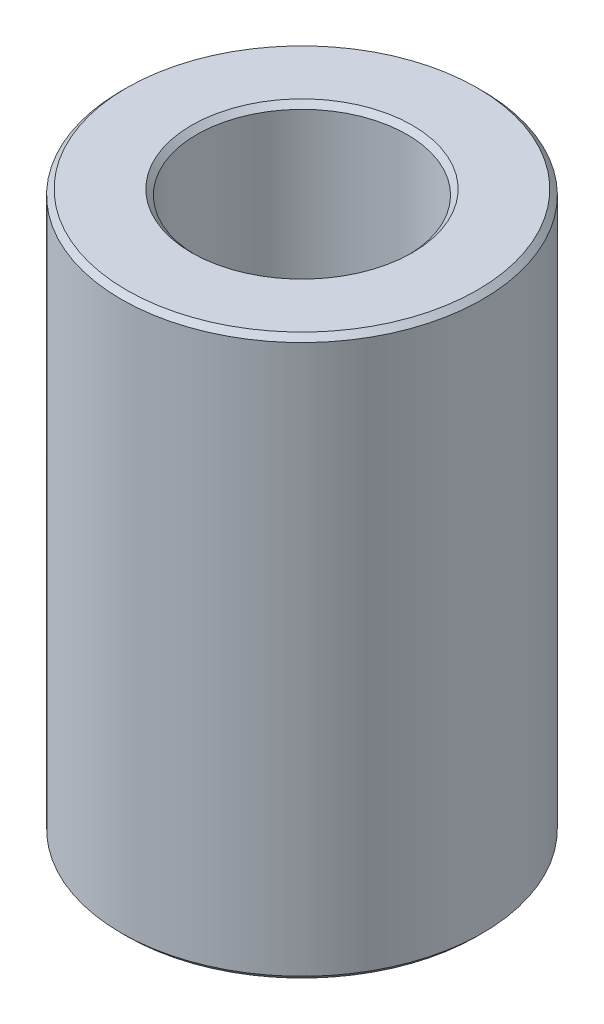
ISO-10303-21;
HEADER;
FILE_DESCRIPTION(('STEP AP214'),'2;1');
FILE_NAME('part.step','',(''),(''),'','','');
FILE_SCHEMA(('AUTOMOTIVE_DESIGN { 1 0 10303 214 1 1 1 1 }'));
ENDSEC;
DATA;
#1=APPLICATION_CONTEXT('core data for automotive mechanical design processes');
#2=APPLICATION_PROTOCOL_DEFINITION('international standard','automotive_design',2000,#1);
#3=PRODUCT_CONTEXT('',#1,'mechanical');
#4=PRODUCT('Part','Part','',(#3));
#5=PRODUCT_RELATED_PRODUCT_CATEGORY('part','',(#4));
#6=PRODUCT_DEFINITION_FORMATION('','',#4);
#7=PRODUCT_DEFINITION_CONTEXT('part definition',#1,'design');
#8=PRODUCT_DEFINITION('design','',#6,#7);
#9=PRODUCT_DEFINITION_SHAPE('','',#8);
#10=(LENGTH_UNIT() NAMED_UNIT(*) SI_UNIT(.MILLI.,.METRE.));
#11=(NAMED_UNIT(*) PLANE_ANGLE_UNIT() SI_UNIT($,.RADIAN.));
#12=(NAMED_UNIT(*) SI_UNIT($,.STERADIAN.) SOLID_ANGLE_UNIT());
#13=UNCERTAINTY_MEASURE_WITH_UNIT(LENGTH_MEASURE(1.E-05),#10,'distance_accuracy_value','');
#14=(GEOMETRIC_REPRESENTATION_CONTEXT(3) GLOBAL_UNCERTAINTY_ASSIGNED_CONTEXT((#13)) GLOBAL_UNIT_ASSIGNED_CONTEXT((#10,
#11,#12)) REPRESENTATION_CONTEXT('',''));
#15=CARTESIAN_POINT('',(0.,0.,0.));
#16=DIRECTION('',(0.,0.,1.));
#17=DIRECTION('',(1.,0.,0.));
#18=AXIS2_PLACEMENT_3D('',#15,#16,#17);
#19=CARTESIAN_POINT('',(0.,77.4477577079543,0.));
#20=DIRECTION('',(0.,-1.,0.));
#21=DIRECTION('',(0.,0.,-1.));
#22=AXIS2_PLACEMENT_3D('',#19,#20,#21);
#23=CYLINDRICAL_SURFACE('',#22,25.);
#24=CARTESIAN_POINT('',(0.,0.737116415346989,0.));
#25=DIRECTION('',(0.,1.,0.));
#26=DIRECTION('',(0.,0.,1.));
#27=AXIS2_PLACEMENT_3D('',#24,#25,#26);
#28=CIRCLE('',#27,25.);
#29=CARTESIAN_POINT('',(0.,0.737116415346989,25.));
#30=VERTEX_POINT('',#29);
#31=EDGE_CURVE('E10',#30,#30,#28,.T.);
#32=ORIENTED_EDGE('',*,*,#31,.T.);
#33=EDGE_LOOP('',(#32));
#34=FACE_BOUND('',#33,.T.);
#35=CARTESIAN_POINT('',(0.,76.7106412926073,0.));
#36=DIRECTION('',(0.,1.,0.));
#37=DIRECTION('',(0.,0.,1.));
#38=AXIS2_PLACEMENT_3D('',#35,#36,#37);
#39=CIRCLE('',#38,25.);
#40=CARTESIAN_POINT('',(0.,76.7106412926073,25.));
#41=VERTEX_POINT('',#40);
#42=EDGE_CURVE('E50',#41,#41,#39,.F.);
#43=ORIENTED_EDGE('',*,*,#42,.T.);
#44=EDGE_LOOP('',(#43));
#45=FACE_BOUND('',#44,.T.);
#46=ADVANCED_FACE('F39',(#34,#45),#23,.T.);
#47=CARTESIAN_POINT('',(0.,77.4477577079543,0.));
#48=DIRECTION('',(0.,1.,0.));
#49=DIRECTION('',(0.,0.,1.));
#50=AXIS2_PLACEMENT_3D('',#47,#48,#49);
#51=PLANE('',#50);
#52=CARTESIAN_POINT('',(0.,77.4477577079543,0.));
#53=DIRECTION('',(0.,1.,0.));
#54=DIRECTION('',(0.,0.,1.));
#55=AXIS2_PLACEMENT_3D('',#52,#53,#54);
#56=CIRCLE('',#55,15.286187905594);
#57=CARTESIAN_POINT('',(0.,77.4477577079543,15.286187905594));
#58=VERTEX_POINT('',#57);
#59=EDGE_CURVE('E58',#58,#58,#56,.F.);
#60=ORIENTED_EDGE('',*,*,#59,.T.);
#61=EDGE_LOOP('',(#60));
#62=FACE_BOUND('',#61,.T.);
#63=CARTESIAN_POINT('',(0.,77.4477577079543,0.));
#64=DIRECTION('',(0.,1.,0.));
#65=DIRECTION('',(0.,0.,1.));
#66=AXIS2_PLACEMENT_3D('',#63,#64,#65);
#67=CIRCLE('',#66,24.262883584653);
#68=CARTESIAN_POINT('',(0.,77.4477577079543,24.262883584653));
#69=VERTEX_POINT('',#68);
#70=EDGE_CURVE('E61',#69,#69,#67,.T.);
#71=ORIENTED_EDGE('',*,*,#70,.T.);
#72=EDGE_LOOP('',(#71));
#73=FACE_BOUND('',#72,.T.);
#74=ADVANCED_FACE('F88',(#62,#73),#51,.T.);
#75=CARTESIAN_POINT('',(0.,0.,0.));
#76=DIRECTION('',(0.,1.,0.));
#77=DIRECTION('',(0.,0.,1.));
#78=AXIS2_PLACEMENT_3D('',#75,#76,#77);
#79=PLANE('',#78);
#80=CARTESIAN_POINT('',(0.,0.,0.));
#81=DIRECTION('',(0.,1.,0.));
#82=DIRECTION('',(0.,0.,1.));
#83=AXIS2_PLACEMENT_3D('',#80,#81,#82);
#84=CIRCLE('',#83,15.286187905594);
#85=CARTESIAN_POINT('',(0.,0.,15.286187905594));
#86=VERTEX_POINT('',#85);
#87=EDGE_CURVE('E51',#86,#86,#84,.T.);
#88=ORIENTED_EDGE('',*,*,#87,.T.);
#89=EDGE_LOOP('',(#88));
#90=FACE_BOUND('',#89,.T.);
#91=CARTESIAN_POINT('',(0.,0.,0.));
#92=DIRECTION('',(0.,1.,0.));
#93=DIRECTION('',(0.,0.,1.));
#94=AXIS2_PLACEMENT_3D('',#91,#92,#93);
#95=CIRCLE('',#94,24.262883584653);
#96=CARTESIAN_POINT('',(0.,0.,24.262883584653));
#97=VERTEX_POINT('',#96);
#98=EDGE_CURVE('E54',#97,#97,#95,.F.);
#99=ORIENTED_EDGE('',*,*,#98,.T.);
#100=EDGE_LOOP('',(#99));
#101=FACE_BOUND('',#100,.T.);
#102=ADVANCED_FACE('F83',(#90,#101),#79,.F.);
#103=CARTESIAN_POINT('',(0.,77.4477577079543,0.));
#104=DIRECTION('',(0.,-1.,0.));
#105=DIRECTION('',(0.,0.,-1.));
#106=AXIS2_PLACEMENT_3D('',#103,#104,#105);
#107=CYLINDRICAL_SURFACE('',#106,14.549071490247);
#108=CARTESIAN_POINT('',(0.,76.7106412926073,0.));
#109=DIRECTION('',(0.,1.,0.));
#110=DIRECTION('',(0.,0.,1.));
#111=AXIS2_PLACEMENT_3D('',#108,#109,#110);
#112=CIRCLE('',#111,14.549071490247);
#113=CARTESIAN_POINT('',(0.,76.7106412926073,14.549071490247));
#114=VERTEX_POINT('',#113);
#115=EDGE_CURVE('E67',#114,#114,#112,.T.);
#116=ORIENTED_EDGE('',*,*,#115,.T.);
#117=EDGE_LOOP('',(#116));
#118=FACE_BOUND('',#117,.T.);
#119=CARTESIAN_POINT('',(0.,0.737116415346989,0.));
#120=DIRECTION('',(0.,1.,0.));
#121=DIRECTION('',(0.,0.,1.));
#122=AXIS2_PLACEMENT_3D('',#119,#120,#121);
#123=CIRCLE('',#122,14.549071490247);
#124=CARTESIAN_POINT('',(0.,0.737116415346989,14.549071490247));
#125=VERTEX_POINT('',#124);
#126=EDGE_CURVE('E69',#125,#125,#123,.F.);
#127=ORIENTED_EDGE('',*,*,#126,.T.);
#128=EDGE_LOOP('',(#127));
#129=FACE_BOUND('',#128,.T.);
#130=ADVANCED_FACE('F71',(#118,#129),#107,.F.);
#131=CARTESIAN_POINT('',(0.,76.7106412926073,0.));
#132=DIRECTION('',(0.,1.,0.));
#133=DIRECTION('',(0.,0.,1.));
#134=AXIS2_PLACEMENT_3D('',#131,#132,#133);
#135=CONICAL_SURFACE('',#134,14.549071490247,0.785398163397448);
#136=ORIENTED_EDGE('',*,*,#59,.F.);
#137=EDGE_LOOP('',(#136));
#138=FACE_BOUND('',#137,.T.);
#139=ORIENTED_EDGE('',*,*,#115,.F.);
#140=EDGE_LOOP('',(#139));
#141=FACE_BOUND('',#140,.T.);
#142=ADVANCED_FACE('F77',(#138,#141),#135,.F.);
#143=CARTESIAN_POINT('',(0.,0.,0.));
#144=DIRECTION('',(0.,-1.,0.));
#145=DIRECTION('',(0.,0.,-1.));
#146=AXIS2_PLACEMENT_3D('',#143,#144,#145);
#147=CONICAL_SURFACE('',#146,15.286187905594,0.785398163397458);
#148=ORIENTED_EDGE('',*,*,#126,.F.);
#149=EDGE_LOOP('',(#148));
#150=FACE_BOUND('',#149,.T.);
#151=ORIENTED_EDGE('',*,*,#87,.F.);
#152=EDGE_LOOP('',(#151));
#153=FACE_BOUND('',#152,.T.);
#154=ADVANCED_FACE('F73',(#150,#153),#147,.F.);
#155=CARTESIAN_POINT('',(0.,0.737116415346989,0.));
#156=DIRECTION('',(0.,1.,0.));
#157=DIRECTION('',(0.,0.,1.));
#158=AXIS2_PLACEMENT_3D('',#155,#156,#157);
#159=CONICAL_SURFACE('',#158,25.,0.785398163397451);
#160=ORIENTED_EDGE('',*,*,#98,.F.);
#161=EDGE_LOOP('',(#160));
#162=FACE_BOUND('',#161,.T.);
#163=ORIENTED_EDGE('',*,*,#31,.F.);
#164=EDGE_LOOP('',(#163));
#165=FACE_BOUND('',#164,.T.);
#166=ADVANCED_FACE('F76',(#162,#165),#159,.T.);
#167=CARTESIAN_POINT('',(0.,77.4477577079543,0.));
#168=DIRECTION('',(0.,-1.,0.));
#169=DIRECTION('',(0.,0.,-1.));
#170=AXIS2_PLACEMENT_3D('',#167,#168,#169);
#171=CONICAL_SURFACE('',#170,24.262883584653,0.785398163397434);
#172=ORIENTED_EDGE('',*,*,#42,.F.);
#173=EDGE_LOOP('',(#172));
#174=FACE_BOUND('',#173,.T.);
#175=ORIENTED_EDGE('',*,*,#70,.F.);
#176=EDGE_LOOP('',(#175));
#177=FACE_BOUND('',#176,.T.);
#178=ADVANCED_FACE('F45',(#174,#177),#171,.T.);
#179=CLOSED_SHELL('',(#46,#74,#102,#130,#142,#154,#166,#178));
#180=MANIFOLD_SOLID_BREP('B2',#179);
#181=ADVANCED_BREP_SHAPE_REPRESENTATION('',(#18,#180),#14);
#182=SHAPE_DEFINITION_REPRESENTATION(#9,#181);
ENDSEC;
END-ISO-10303-21;
